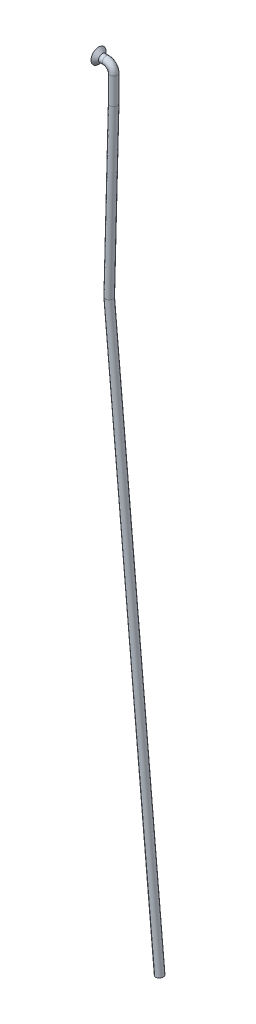
ISO-10303-21;
HEADER;
FILE_DESCRIPTION(('STEP AP214'),'2;1');
FILE_NAME('part.step','',(''),(''),'','','');
FILE_SCHEMA(('AUTOMOTIVE_DESIGN { 1 0 10303 214 1 1 1 1 }'));
ENDSEC;
DATA;
#1=APPLICATION_CONTEXT('core data for automotive mechanical design processes');
#2=APPLICATION_PROTOCOL_DEFINITION('international standard','automotive_design',2000,#1);
#3=PRODUCT_CONTEXT('',#1,'mechanical');
#4=PRODUCT('Part','Part','',(#3));
#5=PRODUCT_RELATED_PRODUCT_CATEGORY('part','',(#4));
#6=PRODUCT_DEFINITION_FORMATION('','',#4);
#7=PRODUCT_DEFINITION_CONTEXT('part definition',#1,'design');
#8=PRODUCT_DEFINITION('design','',#6,#7);
#9=PRODUCT_DEFINITION_SHAPE('','',#8);
#10=(LENGTH_UNIT() NAMED_UNIT(*) SI_UNIT(.MILLI.,.METRE.));
#11=(NAMED_UNIT(*) PLANE_ANGLE_UNIT() SI_UNIT($,.RADIAN.));
#12=(NAMED_UNIT(*) SI_UNIT($,.STERADIAN.) SOLID_ANGLE_UNIT());
#13=UNCERTAINTY_MEASURE_WITH_UNIT(LENGTH_MEASURE(1.E-05),#10,'distance_accuracy_value','');
#14=(GEOMETRIC_REPRESENTATION_CONTEXT(3) GLOBAL_UNCERTAINTY_ASSIGNED_CONTEXT((#13)) GLOBAL_UNIT_ASSIGNED_CONTEXT((#10,
#11,#12)) REPRESENTATION_CONTEXT('',''));
#15=CARTESIAN_POINT('',(0.,0.,0.));
#16=DIRECTION('',(0.,0.,1.));
#17=DIRECTION('',(1.,0.,0.));
#18=AXIS2_PLACEMENT_3D('',#15,#16,#17);
#19=CARTESIAN_POINT('',(-1.17796267385412,-53.9845796238995,0.));
#20=DIRECTION('',(0.0893623748500438,-0.995999179699038,0.));
#21=DIRECTION('',(0.99599917969904,0.0893623748500435,0.));
#22=AXIS2_PLACEMENT_3D('',#19,#20,#21);
#23=CYLINDRICAL_SURFACE('',#22,0.999999999999998);
#24=CARTESIAN_POINT('',(-1.17796267385412,-53.9845796238995,0.));
#25=DIRECTION('',(0.0316456164191054,-0.999499152056394,0.));
#26=DIRECTION('',(-0.999499152056396,-0.0316456164191053,0.));
#27=AXIS2_PLACEMENT_3D('',#24,#25,#26);
#28=ELLIPSE('',#27,1.00167453638959,0.999999999999998);
#29=CARTESIAN_POINT('',(-2.179135523612,-54.0162782320549,0.));
#30=VERTEX_POINT('',#29);
#31=EDGE_CURVE('E38',#30,#30,#28,.T.);
#32=ORIENTED_EDGE('',*,*,#31,.T.);
#33=EDGE_LOOP('',(#32));
#34=FACE_BOUND('',#33,.T.);
#35=CARTESIAN_POINT('',(12.1949584809307,-203.034093165774,0.));
#36=DIRECTION('',(0.0893623748500438,-0.995999179699038,0.));
#37=DIRECTION('',(0.99599917969904,0.0893623748500435,0.));
#38=AXIS2_PLACEMENT_3D('',#35,#36,#37);
#39=CIRCLE('',#38,0.999999999999998);
#40=CARTESIAN_POINT('',(13.1909576606298,-202.944730790924,0.));
#41=VERTEX_POINT('',#40);
#42=EDGE_CURVE('E11',#41,#41,#39,.F.);
#43=ORIENTED_EDGE('',*,*,#42,.T.);
#44=EDGE_LOOP('',(#43));
#45=FACE_BOUND('',#44,.T.);
#46=ADVANCED_FACE('F32',(#34,#45),#23,.T.);
#47=CARTESIAN_POINT('',(0.,-8.99999999999991,0.));
#48=DIRECTION('',(-0.0261769483078694,-0.999657324975555,0.));
#49=DIRECTION('',(0.999657324975557,-0.0261769483078693,0.));
#50=AXIS2_PLACEMENT_3D('',#47,#48,#49);
#51=CYLINDRICAL_SURFACE('',#50,0.999999999999998);
#52=CARTESIAN_POINT('',(0.,-8.99999999999991,0.));
#53=DIRECTION('',(-0.0130895955713425,-0.999914327574005,0.));
#54=DIRECTION('',(0.999914327574007,-0.0130895955713425,0.));
#55=AXIS2_PLACEMENT_3D('',#52,#53,#54);
#56=ELLIPSE('',#55,1.00008567976638,0.999999999999998);
#57=CARTESIAN_POINT('',(1.00000000000003,-9.01309071708474,0.));
#58=VERTEX_POINT('',#57);
#59=EDGE_CURVE('E42',#58,#58,#56,.F.);
#60=ORIENTED_EDGE('',*,*,#59,.F.);
#61=EDGE_LOOP('',(#60));
#62=FACE_BOUND('',#61,.T.);
#63=ORIENTED_EDGE('',*,*,#31,.F.);
#64=EDGE_LOOP('',(#63));
#65=FACE_BOUND('',#64,.T.);
#66=ADVANCED_FACE('F79',(#62,#65),#51,.T.);
#67=CARTESIAN_POINT('',(0.,-1.99999999999974,0.));
#68=DIRECTION('',(0.,-0.999999999999997,0.));
#69=DIRECTION('',(1.,0.,0.));
#70=AXIS2_PLACEMENT_3D('',#67,#68,#69);
#71=CYLINDRICAL_SURFACE('',#70,0.999999999999998);
#72=CARTESIAN_POINT('',(0.,-1.99999999999974,0.));
#73=DIRECTION('',(0.,-0.999999999999997,0.));
#74=DIRECTION('',(0.,0.,-0.999999999999997));
#75=AXIS2_PLACEMENT_3D('',#72,#73,#74);
#76=CIRCLE('',#75,0.999999999999998);
#77=CARTESIAN_POINT('',(1.,-1.99999999999974,0.));
#78=VERTEX_POINT('',#77);
#79=EDGE_CURVE('E46',#78,#78,#76,.T.);
#80=ORIENTED_EDGE('',*,*,#79,.T.);
#81=EDGE_LOOP('',(#80));
#82=FACE_BOUND('',#81,.T.);
#83=ORIENTED_EDGE('',*,*,#59,.T.);
#84=EDGE_LOOP('',(#83));
#85=FACE_BOUND('',#84,.T.);
#86=ADVANCED_FACE('F83',(#82,#85),#71,.T.);
#87=CARTESIAN_POINT('',(-2.,-1.99999999999974,0.));
#88=DIRECTION('',(0.,0.,-0.999999999999997));
#89=DIRECTION('',(-1.,0.,0.));
#90=AXIS2_PLACEMENT_3D('',#87,#88,#89);
#91=TOROIDAL_SURFACE('',#90,2.,0.999999999999998);
#92=CARTESIAN_POINT('',(-2.,0.,0.));
#93=DIRECTION('',(1.,0.,0.));
#94=DIRECTION('',(0.,0.,-0.999999999999997));
#95=AXIS2_PLACEMENT_3D('',#92,#93,#94);
#96=CIRCLE('',#95,0.999999999999998);
#97=CARTESIAN_POINT('',(-2.,1.00000000000026,0.));
#98=VERTEX_POINT('',#97);
#99=EDGE_CURVE('E51',#98,#98,#96,.T.);
#100=CARTESIAN_POINT('',(-2.,-1.99999999999974,0.));
#101=DIRECTION('',(0.,0.,-0.999999999999997));
#102=DIRECTION('',(-1.,0.,0.));
#103=AXIS2_PLACEMENT_3D('',#100,#101,#102);
#104=CIRCLE('',#103,3.);
#105=EDGE_CURVE('',#98,#78,#104,.T.);
#106=ORIENTED_EDGE('',*,*,#99,.T.);
#107=ORIENTED_EDGE('',*,*,#79,.F.);
#108=ORIENTED_EDGE('',*,*,#105,.T.);
#109=ORIENTED_EDGE('',*,*,#105,.F.);
#110=EDGE_LOOP('',(#106,#108,#107,#109));
#111=FACE_BOUND('',#110,.T.);
#112=ADVANCED_FACE('F88',(#111),#91,.T.);
#113=CARTESIAN_POINT('',(-2.,0.,0.));
#114=DIRECTION('',(-1.,0.,0.));
#115=DIRECTION('',(0.,-0.999999999999997,0.));
#116=AXIS2_PLACEMENT_3D('',#113,#114,#115);
#117=CYLINDRICAL_SURFACE('',#116,0.999999999999998);
#118=CARTESIAN_POINT('',(-3.,0.,0.));
#119=DIRECTION('',(1.,0.,0.));
#120=DIRECTION('',(0.,0.999999999999997,0.));
#121=AXIS2_PLACEMENT_3D('',#118,#119,#120);
#122=CIRCLE('',#121,0.999999999999999);
#123=CARTESIAN_POINT('',(-3.,0.999999999999996,0.));
#124=VERTEX_POINT('',#123);
#125=EDGE_CURVE('E57',#124,#124,#122,.T.);
#126=ORIENTED_EDGE('',*,*,#125,.T.);
#127=EDGE_LOOP('',(#126));
#128=FACE_BOUND('',#127,.T.);
#129=ORIENTED_EDGE('',*,*,#99,.F.);
#130=EDGE_LOOP('',(#129));
#131=FACE_BOUND('',#130,.T.);
#132=ADVANCED_FACE('F61',(#128,#131),#117,.T.);
#133=CARTESIAN_POINT('',(12.1949584809307,-203.034093165774,0.));
#134=DIRECTION('',(0.0893623748500438,-0.995999179699038,0.));
#135=DIRECTION('',(0.99599917969904,0.0893623748500435,0.));
#136=AXIS2_PLACEMENT_3D('',#133,#134,#135);
#137=PLANE('',#136);
#138=ORIENTED_EDGE('',*,*,#42,.F.);
#139=EDGE_LOOP('',(#138));
#140=FACE_BOUND('',#139,.T.);
#141=ADVANCED_FACE('F67',(#140),#137,.T.);
#142=CARTESIAN_POINT('',(-3.,0.,0.));
#143=DIRECTION('',(-1.,0.,0.));
#144=DIRECTION('',(0.,-0.999999999999997,0.));
#145=AXIS2_PLACEMENT_3D('',#142,#143,#144);
#146=CONICAL_SURFACE('',#145,0.999999999999999,0.785398163397449);
#147=CARTESIAN_POINT('',(-3.99999999999998,0.,0.));
#148=DIRECTION('',(1.,0.,0.));
#149=DIRECTION('',(0.,0.999999999999997,0.));
#150=AXIS2_PLACEMENT_3D('',#147,#148,#149);
#151=CIRCLE('',#150,2.);
#152=CARTESIAN_POINT('',(-3.99999999999998,1.99999999999999,0.));
#153=VERTEX_POINT('',#152);
#154=EDGE_CURVE('E54',#153,#153,#151,.T.);
#155=ORIENTED_EDGE('',*,*,#154,.T.);
#156=EDGE_LOOP('',(#155));
#157=FACE_BOUND('',#156,.T.);
#158=ORIENTED_EDGE('',*,*,#125,.F.);
#159=EDGE_LOOP('',(#158));
#160=FACE_BOUND('',#159,.T.);
#161=ADVANCED_FACE('F64',(#157,#160),#146,.T.);
#162=CARTESIAN_POINT('',(-3.99999999999998,0.,0.));
#163=DIRECTION('',(1.,0.,0.));
#164=DIRECTION('',(0.,0.,-0.999999999999997));
#165=AXIS2_PLACEMENT_3D('',#162,#163,#164);
#166=PLANE('',#165);
#167=ORIENTED_EDGE('',*,*,#154,.F.);
#168=EDGE_LOOP('',(#167));
#169=FACE_BOUND('',#168,.T.);
#170=ADVANCED_FACE('F66',(#169),#166,.F.);
#171=CLOSED_SHELL('',(#46,#66,#86,#112,#132,#141,#161,#170));
#172=MANIFOLD_SOLID_BREP('B2',#171);
#173=ADVANCED_BREP_SHAPE_REPRESENTATION('',(#18,#172),#14);
#174=SHAPE_DEFINITION_REPRESENTATION(#9,#173);
ENDSEC;
END-ISO-10303-21;
